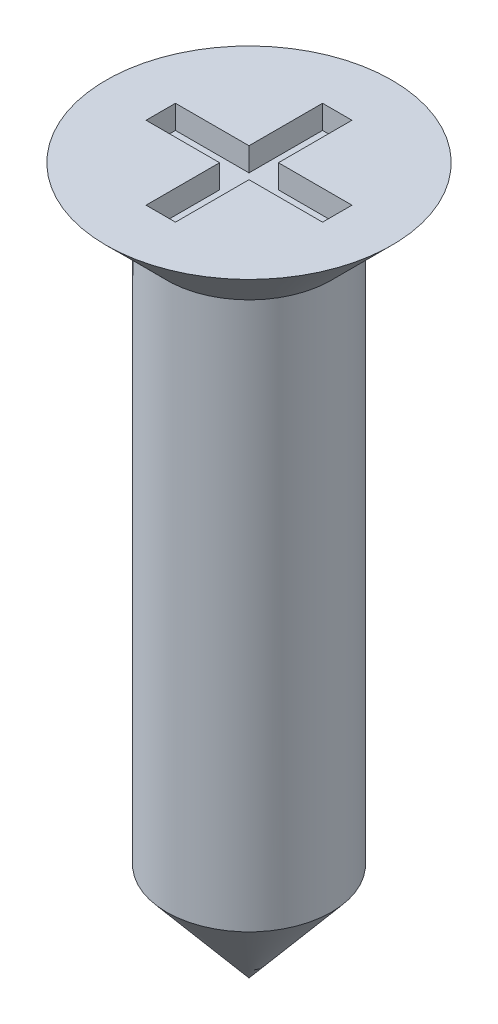
ISO-10303-21;
HEADER;
FILE_DESCRIPTION(('STEP AP214'),'2;1');
FILE_NAME('part.step','',(''),(''),'','','');
FILE_SCHEMA(('AUTOMOTIVE_DESIGN { 1 0 10303 214 1 1 1 1 }'));
ENDSEC;
DATA;
#1=APPLICATION_CONTEXT('core data for automotive mechanical design processes');
#2=APPLICATION_PROTOCOL_DEFINITION('international standard','automotive_design',2000,#1);
#3=PRODUCT_CONTEXT('',#1,'mechanical');
#4=PRODUCT('Part','Part','',(#3));
#5=PRODUCT_RELATED_PRODUCT_CATEGORY('part','',(#4));
#6=PRODUCT_DEFINITION_FORMATION('','',#4);
#7=PRODUCT_DEFINITION_CONTEXT('part definition',#1,'design');
#8=PRODUCT_DEFINITION('design','',#6,#7);
#9=PRODUCT_DEFINITION_SHAPE('','',#8);
#10=(LENGTH_UNIT() NAMED_UNIT(*) SI_UNIT(.MILLI.,.METRE.));
#11=(NAMED_UNIT(*) PLANE_ANGLE_UNIT() SI_UNIT($,.RADIAN.));
#12=(NAMED_UNIT(*) SI_UNIT($,.STERADIAN.) SOLID_ANGLE_UNIT());
#13=UNCERTAINTY_MEASURE_WITH_UNIT(LENGTH_MEASURE(1.E-05),#10,'distance_accuracy_value','');
#14=(GEOMETRIC_REPRESENTATION_CONTEXT(3) GLOBAL_UNCERTAINTY_ASSIGNED_CONTEXT((#13)) GLOBAL_UNIT_ASSIGNED_CONTEXT((#10,
#11,#12)) REPRESENTATION_CONTEXT('',''));
#15=CARTESIAN_POINT('',(0.,0.,0.));
#16=DIRECTION('',(0.,0.,1.));
#17=DIRECTION('',(1.,0.,0.));
#18=AXIS2_PLACEMENT_3D('',#15,#16,#17);
#19=CARTESIAN_POINT('',(0.,-5.16577248518406,0.));
#20=DIRECTION('',(0.,1.,0.));
#21=DIRECTION('',(0.,0.,1.));
#22=AXIS2_PLACEMENT_3D('',#19,#20,#21);
#23=CONICAL_SURFACE('',#22,0.699999999999999,0.698131700797737);
#24=CARTESIAN_POINT('',(0.,-6.,0.));
#25=VERTEX_POINT('',#24);
#26=VERTEX_LOOP('',#25);
#27=FACE_BOUND('',#26,.T.);
#28=CARTESIAN_POINT('',(0.,-5.16577248518406,0.));
#29=DIRECTION('',(0.,-1.,0.));
#30=DIRECTION('',(0.,0.,-1.));
#31=AXIS2_PLACEMENT_3D('',#28,#29,#30);
#32=CIRCLE('',#31,0.699999999999999);
#33=CARTESIAN_POINT('',(0.,-5.16577248518406,-0.699999999999999));
#34=VERTEX_POINT('',#33);
#35=EDGE_CURVE('E11',#34,#34,#32,.T.);
#36=ORIENTED_EDGE('',*,*,#35,.T.);
#37=EDGE_LOOP('',(#36));
#38=FACE_BOUND('',#37,.T.);
#39=ADVANCED_FACE('F36',(#27,#38),#23,.T.);
#40=CARTESIAN_POINT('',(0.,-6.,0.));
#41=DIRECTION('',(0.,-1.,0.));
#42=DIRECTION('',(0.,0.,-1.));
#43=AXIS2_PLACEMENT_3D('',#40,#41,#42);
#44=CYLINDRICAL_SURFACE('',#43,0.7);
#45=ORIENTED_EDGE('',*,*,#35,.F.);
#46=EDGE_LOOP('',(#45));
#47=FACE_BOUND('',#46,.T.);
#48=CARTESIAN_POINT('',(0.,-0.514999999999995,0.));
#49=DIRECTION('',(0.,-1.,0.));
#50=DIRECTION('',(0.,0.,-1.));
#51=AXIS2_PLACEMENT_3D('',#48,#49,#50);
#52=CIRCLE('',#51,0.7);
#53=CARTESIAN_POINT('',(0.,-0.514999999999995,-0.7));
#54=VERTEX_POINT('',#53);
#55=EDGE_CURVE('E43',#54,#54,#52,.T.);
#56=ORIENTED_EDGE('',*,*,#55,.T.);
#57=EDGE_LOOP('',(#56));
#58=FACE_BOUND('',#57,.T.);
#59=ADVANCED_FACE('F231',(#47,#58),#44,.T.);
#60=CARTESIAN_POINT('',(0.,0.,0.));
#61=DIRECTION('',(0.,1.,0.));
#62=DIRECTION('',(0.,0.,1.));
#63=AXIS2_PLACEMENT_3D('',#60,#61,#62);
#64=CONICAL_SURFACE('',#63,1.215,0.785398163397454);
#65=ORIENTED_EDGE('',*,*,#55,.F.);
#66=EDGE_LOOP('',(#65));
#67=FACE_BOUND('',#66,.T.);
#68=CARTESIAN_POINT('',(0.,0.,0.));
#69=DIRECTION('',(0.,-1.,0.));
#70=DIRECTION('',(0.,0.,-1.));
#71=AXIS2_PLACEMENT_3D('',#68,#69,#70);
#72=CIRCLE('',#71,1.215);
#73=CARTESIAN_POINT('',(0.,0.,-1.215));
#74=VERTEX_POINT('',#73);
#75=EDGE_CURVE('E207',#74,#74,#72,.T.);
#76=ORIENTED_EDGE('',*,*,#75,.T.);
#77=EDGE_LOOP('',(#76));
#78=FACE_BOUND('',#77,.T.);
#79=ADVANCED_FACE('F233',(#67,#78),#64,.T.);
#80=CARTESIAN_POINT('',(0.,0.,0.));
#81=DIRECTION('',(0.,-1.,0.));
#82=DIRECTION('',(0.,0.,-1.));
#83=AXIS2_PLACEMENT_3D('',#80,#81,#82);
#84=PLANE('',#83);
#85=DIRECTION('',(0.,0.,-1.));
#86=VECTOR('',#85,1.);
#87=CARTESIAN_POINT('',(0.125,0.,-0.125));
#88=LINE('',#87,#86);
#89=CARTESIAN_POINT('',(0.125,0.,-0.125));
#90=VERTEX_POINT('',#89);
#91=CARTESIAN_POINT('',(0.125,0.,-0.75));
#92=VERTEX_POINT('',#91);
#93=EDGE_CURVE('E177',#90,#92,#88,.T.);
#94=ORIENTED_EDGE('',*,*,#93,.F.);
#95=DIRECTION('',(-1.,0.,0.));
#96=VECTOR('',#95,1.);
#97=CARTESIAN_POINT('',(0.125,0.,-0.125));
#98=LINE('',#97,#96);
#99=CARTESIAN_POINT('',(0.75,0.,-0.125));
#100=VERTEX_POINT('',#99);
#101=EDGE_CURVE('E50',#100,#90,#98,.T.);
#102=ORIENTED_EDGE('',*,*,#101,.F.);
#103=DIRECTION('',(0.,0.,-1.));
#104=VECTOR('',#103,1.);
#105=CARTESIAN_POINT('',(0.75,0.,0.125));
#106=LINE('',#105,#104);
#107=CARTESIAN_POINT('',(0.75,0.,0.125));
#108=VERTEX_POINT('',#107);
#109=EDGE_CURVE('E145',#108,#100,#106,.T.);
#110=ORIENTED_EDGE('',*,*,#109,.F.);
#111=DIRECTION('',(1.,0.,0.));
#112=VECTOR('',#111,1.);
#113=CARTESIAN_POINT('',(0.125,0.,0.125));
#114=LINE('',#113,#112);
#115=CARTESIAN_POINT('',(0.125,0.,0.125));
#116=VERTEX_POINT('',#115);
#117=EDGE_CURVE('E148',#116,#108,#114,.T.);
#118=ORIENTED_EDGE('',*,*,#117,.F.);
#119=DIRECTION('',(0.,0.,-1.));
#120=VECTOR('',#119,1.);
#121=CARTESIAN_POINT('',(0.125,0.,0.75));
#122=LINE('',#121,#120);
#123=CARTESIAN_POINT('',(0.125,0.,0.75));
#124=VERTEX_POINT('',#123);
#125=EDGE_CURVE('E200',#124,#116,#122,.T.);
#126=ORIENTED_EDGE('',*,*,#125,.F.);
#127=DIRECTION('',(1.,0.,0.));
#128=VECTOR('',#127,1.);
#129=CARTESIAN_POINT('',(-0.125,0.,0.75));
#130=LINE('',#129,#128);
#131=CARTESIAN_POINT('',(-0.125,0.,0.75));
#132=VERTEX_POINT('',#131);
#133=EDGE_CURVE('E197',#132,#124,#130,.T.);
#134=ORIENTED_EDGE('',*,*,#133,.F.);
#135=DIRECTION('',(0.,0.,1.));
#136=VECTOR('',#135,1.);
#137=CARTESIAN_POINT('',(-0.125,0.,0.75));
#138=LINE('',#137,#136);
#139=CARTESIAN_POINT('',(-0.125,0.,0.125));
#140=VERTEX_POINT('',#139);
#141=EDGE_CURVE('E194',#140,#132,#138,.T.);
#142=ORIENTED_EDGE('',*,*,#141,.F.);
#143=DIRECTION('',(1.,0.,0.));
#144=VECTOR('',#143,1.);
#145=CARTESIAN_POINT('',(-0.75,0.,0.125));
#146=LINE('',#145,#144);
#147=CARTESIAN_POINT('',(-0.75,0.,0.125));
#148=VERTEX_POINT('',#147);
#149=EDGE_CURVE('E191',#148,#140,#146,.T.);
#150=ORIENTED_EDGE('',*,*,#149,.F.);
#151=DIRECTION('',(0.,0.,1.));
#152=VECTOR('',#151,1.);
#153=CARTESIAN_POINT('',(-0.75,0.,0.125));
#154=LINE('',#153,#152);
#155=CARTESIAN_POINT('',(-0.75,0.,-0.125));
#156=VERTEX_POINT('',#155);
#157=EDGE_CURVE('E188',#156,#148,#154,.T.);
#158=ORIENTED_EDGE('',*,*,#157,.F.);
#159=DIRECTION('',(-1.,0.,0.));
#160=VECTOR('',#159,1.);
#161=CARTESIAN_POINT('',(-0.75,0.,-0.125));
#162=LINE('',#161,#160);
#163=CARTESIAN_POINT('',(-0.125,0.,-0.125));
#164=VERTEX_POINT('',#163);
#165=EDGE_CURVE('E185',#164,#156,#162,.T.);
#166=ORIENTED_EDGE('',*,*,#165,.F.);
#167=DIRECTION('',(0.,0.,1.));
#168=VECTOR('',#167,1.);
#169=CARTESIAN_POINT('',(-0.125,0.,-0.125));
#170=LINE('',#169,#168);
#171=CARTESIAN_POINT('',(-0.125,0.,-0.75));
#172=VERTEX_POINT('',#171);
#173=EDGE_CURVE('E182',#172,#164,#170,.T.);
#174=ORIENTED_EDGE('',*,*,#173,.F.);
#175=DIRECTION('',(-1.,0.,0.));
#176=VECTOR('',#175,1.);
#177=CARTESIAN_POINT('',(-0.125,0.,-0.75));
#178=LINE('',#177,#176);
#179=EDGE_CURVE('E179',#92,#172,#178,.T.);
#180=ORIENTED_EDGE('',*,*,#179,.F.);
#181=EDGE_LOOP('',(#94,#102,#110,#118,#126,#134,#142,#150,#158,#166,#174,#180));
#182=FACE_BOUND('',#181,.T.);
#183=ORIENTED_EDGE('',*,*,#75,.F.);
#184=EDGE_LOOP('',(#183));
#185=FACE_BOUND('',#184,.T.);
#186=ADVANCED_FACE('F236',(#182,#185),#84,.F.);
#187=CARTESIAN_POINT('',(0.125,-0.2,-0.125));
#188=DIRECTION('',(0.,0.,-1.));
#189=DIRECTION('',(-1.,0.,0.));
#190=AXIS2_PLACEMENT_3D('',#187,#188,#189);
#191=PLANE('',#190);
#192=ORIENTED_EDGE('',*,*,#101,.T.);
#193=DIRECTION('',(0.,1.,0.));
#194=VECTOR('',#193,1.);
#195=CARTESIAN_POINT('',(0.125,-0.2,-0.125));
#196=LINE('',#195,#194);
#197=CARTESIAN_POINT('',(0.125,-0.2,-0.125));
#198=VERTEX_POINT('',#197);
#199=EDGE_CURVE('E122',#198,#90,#196,.T.);
#200=ORIENTED_EDGE('',*,*,#199,.F.);
#201=DIRECTION('',(-1.,0.,0.));
#202=VECTOR('',#201,1.);
#203=CARTESIAN_POINT('',(0.125,-0.2,-0.125));
#204=LINE('',#203,#202);
#205=CARTESIAN_POINT('',(0.75,-0.2,-0.125));
#206=VERTEX_POINT('',#205);
#207=EDGE_CURVE('E126',#206,#198,#204,.T.);
#208=ORIENTED_EDGE('',*,*,#207,.F.);
#209=DIRECTION('',(0.,1.,0.));
#210=VECTOR('',#209,1.);
#211=CARTESIAN_POINT('',(0.75,-0.2,-0.125));
#212=LINE('',#211,#210);
#213=EDGE_CURVE('E205',#206,#100,#212,.T.);
#214=ORIENTED_EDGE('',*,*,#213,.T.);
#215=EDGE_LOOP('',(#192,#200,#208,#214));
#216=FACE_BOUND('',#215,.T.);
#217=ADVANCED_FACE('F124',(#216),#191,.F.);
#218=CARTESIAN_POINT('',(0.75,-0.2,0.125));
#219=DIRECTION('',(1.,0.,0.));
#220=DIRECTION('',(0.,0.,-1.));
#221=AXIS2_PLACEMENT_3D('',#218,#219,#220);
#222=PLANE('',#221);
#223=ORIENTED_EDGE('',*,*,#109,.T.);
#224=ORIENTED_EDGE('',*,*,#213,.F.);
#225=DIRECTION('',(0.,0.,-1.));
#226=VECTOR('',#225,1.);
#227=CARTESIAN_POINT('',(0.75,-0.2,0.125));
#228=LINE('',#227,#226);
#229=CARTESIAN_POINT('',(0.75,-0.2,0.125));
#230=VERTEX_POINT('',#229);
#231=EDGE_CURVE('E132',#230,#206,#228,.T.);
#232=ORIENTED_EDGE('',*,*,#231,.F.);
#233=DIRECTION('',(0.,1.,0.));
#234=VECTOR('',#233,1.);
#235=CARTESIAN_POINT('',(0.75,-0.2,0.125));
#236=LINE('',#235,#234);
#237=EDGE_CURVE('E208',#230,#108,#236,.T.);
#238=ORIENTED_EDGE('',*,*,#237,.T.);
#239=EDGE_LOOP('',(#223,#224,#232,#238));
#240=FACE_BOUND('',#239,.T.);
#241=ADVANCED_FACE('F246',(#240),#222,.F.);
#242=CARTESIAN_POINT('',(0.125,-0.2,0.125));
#243=DIRECTION('',(0.,0.,1.));
#244=DIRECTION('',(1.,0.,0.));
#245=AXIS2_PLACEMENT_3D('',#242,#243,#244);
#246=PLANE('',#245);
#247=ORIENTED_EDGE('',*,*,#117,.T.);
#248=ORIENTED_EDGE('',*,*,#237,.F.);
#249=DIRECTION('',(1.,0.,0.));
#250=VECTOR('',#249,1.);
#251=CARTESIAN_POINT('',(0.125,-0.2,0.125));
#252=LINE('',#251,#250);
#253=CARTESIAN_POINT('',(0.125,-0.2,0.125));
#254=VERTEX_POINT('',#253);
#255=EDGE_CURVE('E173',#254,#230,#252,.T.);
#256=ORIENTED_EDGE('',*,*,#255,.F.);
#257=DIRECTION('',(0.,1.,0.));
#258=VECTOR('',#257,1.);
#259=CARTESIAN_POINT('',(0.125,-0.2,0.125));
#260=LINE('',#259,#258);
#261=EDGE_CURVE('E210',#254,#116,#260,.T.);
#262=ORIENTED_EDGE('',*,*,#261,.T.);
#263=EDGE_LOOP('',(#247,#248,#256,#262));
#264=FACE_BOUND('',#263,.T.);
#265=ADVANCED_FACE('F280',(#264),#246,.F.);
#266=CARTESIAN_POINT('',(0.125,-0.2,0.75));
#267=DIRECTION('',(1.,0.,0.));
#268=DIRECTION('',(0.,0.,-1.));
#269=AXIS2_PLACEMENT_3D('',#266,#267,#268);
#270=PLANE('',#269);
#271=ORIENTED_EDGE('',*,*,#125,.T.);
#272=ORIENTED_EDGE('',*,*,#261,.F.);
#273=DIRECTION('',(0.,0.,-1.));
#274=VECTOR('',#273,1.);
#275=CARTESIAN_POINT('',(0.125,-0.2,0.75));
#276=LINE('',#275,#274);
#277=CARTESIAN_POINT('',(0.125,-0.2,0.75));
#278=VERTEX_POINT('',#277);
#279=EDGE_CURVE('E170',#278,#254,#276,.T.);
#280=ORIENTED_EDGE('',*,*,#279,.F.);
#281=DIRECTION('',(0.,1.,0.));
#282=VECTOR('',#281,1.);
#283=CARTESIAN_POINT('',(0.125,-0.2,0.75));
#284=LINE('',#283,#282);
#285=EDGE_CURVE('E212',#278,#124,#284,.T.);
#286=ORIENTED_EDGE('',*,*,#285,.T.);
#287=EDGE_LOOP('',(#271,#272,#280,#286));
#288=FACE_BOUND('',#287,.T.);
#289=ADVANCED_FACE('F290',(#288),#270,.F.);
#290=CARTESIAN_POINT('',(-0.125,-0.2,0.75));
#291=DIRECTION('',(0.,0.,1.));
#292=DIRECTION('',(1.,0.,0.));
#293=AXIS2_PLACEMENT_3D('',#290,#291,#292);
#294=PLANE('',#293);
#295=ORIENTED_EDGE('',*,*,#133,.T.);
#296=ORIENTED_EDGE('',*,*,#285,.F.);
#297=DIRECTION('',(1.,0.,0.));
#298=VECTOR('',#297,1.);
#299=CARTESIAN_POINT('',(-0.125,-0.2,0.75));
#300=LINE('',#299,#298);
#301=CARTESIAN_POINT('',(-0.125,-0.2,0.75));
#302=VERTEX_POINT('',#301);
#303=EDGE_CURVE('E167',#302,#278,#300,.T.);
#304=ORIENTED_EDGE('',*,*,#303,.F.);
#305=DIRECTION('',(0.,1.,0.));
#306=VECTOR('',#305,1.);
#307=CARTESIAN_POINT('',(-0.125,-0.2,0.75));
#308=LINE('',#307,#306);
#309=EDGE_CURVE('E214',#302,#132,#308,.T.);
#310=ORIENTED_EDGE('',*,*,#309,.T.);
#311=EDGE_LOOP('',(#295,#296,#304,#310));
#312=FACE_BOUND('',#311,.T.);
#313=ADVANCED_FACE('F300',(#312),#294,.F.);
#314=CARTESIAN_POINT('',(-0.125,-0.2,0.75));
#315=DIRECTION('',(-1.,0.,0.));
#316=DIRECTION('',(0.,0.,1.));
#317=AXIS2_PLACEMENT_3D('',#314,#315,#316);
#318=PLANE('',#317);
#319=ORIENTED_EDGE('',*,*,#141,.T.);
#320=ORIENTED_EDGE('',*,*,#309,.F.);
#321=DIRECTION('',(0.,0.,1.));
#322=VECTOR('',#321,1.);
#323=CARTESIAN_POINT('',(-0.125,-0.2,0.75));
#324=LINE('',#323,#322);
#325=CARTESIAN_POINT('',(-0.125,-0.2,0.125));
#326=VERTEX_POINT('',#325);
#327=EDGE_CURVE('E164',#326,#302,#324,.T.);
#328=ORIENTED_EDGE('',*,*,#327,.F.);
#329=DIRECTION('',(0.,1.,0.));
#330=VECTOR('',#329,1.);
#331=CARTESIAN_POINT('',(-0.125,-0.2,0.125));
#332=LINE('',#331,#330);
#333=EDGE_CURVE('E216',#326,#140,#332,.T.);
#334=ORIENTED_EDGE('',*,*,#333,.T.);
#335=EDGE_LOOP('',(#319,#320,#328,#334));
#336=FACE_BOUND('',#335,.T.);
#337=ADVANCED_FACE('F310',(#336),#318,.F.);
#338=CARTESIAN_POINT('',(-0.75,-0.2,0.125));
#339=DIRECTION('',(0.,0.,1.));
#340=DIRECTION('',(1.,0.,0.));
#341=AXIS2_PLACEMENT_3D('',#338,#339,#340);
#342=PLANE('',#341);
#343=ORIENTED_EDGE('',*,*,#149,.T.);
#344=ORIENTED_EDGE('',*,*,#333,.F.);
#345=DIRECTION('',(1.,0.,0.));
#346=VECTOR('',#345,1.);
#347=CARTESIAN_POINT('',(-0.75,-0.2,0.125));
#348=LINE('',#347,#346);
#349=CARTESIAN_POINT('',(-0.75,-0.2,0.125));
#350=VERTEX_POINT('',#349);
#351=EDGE_CURVE('E161',#350,#326,#348,.T.);
#352=ORIENTED_EDGE('',*,*,#351,.F.);
#353=DIRECTION('',(0.,1.,0.));
#354=VECTOR('',#353,1.);
#355=CARTESIAN_POINT('',(-0.75,-0.2,0.125));
#356=LINE('',#355,#354);
#357=EDGE_CURVE('E218',#350,#148,#356,.T.);
#358=ORIENTED_EDGE('',*,*,#357,.T.);
#359=EDGE_LOOP('',(#343,#344,#352,#358));
#360=FACE_BOUND('',#359,.T.);
#361=ADVANCED_FACE('F320',(#360),#342,.F.);
#362=CARTESIAN_POINT('',(-0.75,-0.2,0.125));
#363=DIRECTION('',(-1.,0.,0.));
#364=DIRECTION('',(0.,0.,1.));
#365=AXIS2_PLACEMENT_3D('',#362,#363,#364);
#366=PLANE('',#365);
#367=ORIENTED_EDGE('',*,*,#157,.T.);
#368=ORIENTED_EDGE('',*,*,#357,.F.);
#369=DIRECTION('',(0.,0.,1.));
#370=VECTOR('',#369,1.);
#371=CARTESIAN_POINT('',(-0.75,-0.2,0.125));
#372=LINE('',#371,#370);
#373=CARTESIAN_POINT('',(-0.75,-0.2,-0.125));
#374=VERTEX_POINT('',#373);
#375=EDGE_CURVE('E158',#374,#350,#372,.T.);
#376=ORIENTED_EDGE('',*,*,#375,.F.);
#377=DIRECTION('',(0.,1.,0.));
#378=VECTOR('',#377,1.);
#379=CARTESIAN_POINT('',(-0.75,-0.2,-0.125));
#380=LINE('',#379,#378);
#381=EDGE_CURVE('E220',#374,#156,#380,.T.);
#382=ORIENTED_EDGE('',*,*,#381,.T.);
#383=EDGE_LOOP('',(#367,#368,#376,#382));
#384=FACE_BOUND('',#383,.T.);
#385=ADVANCED_FACE('F330',(#384),#366,.F.);
#386=CARTESIAN_POINT('',(-0.75,-0.2,-0.125));
#387=DIRECTION('',(0.,0.,-1.));
#388=DIRECTION('',(-1.,0.,0.));
#389=AXIS2_PLACEMENT_3D('',#386,#387,#388);
#390=PLANE('',#389);
#391=ORIENTED_EDGE('',*,*,#165,.T.);
#392=ORIENTED_EDGE('',*,*,#381,.F.);
#393=DIRECTION('',(-1.,0.,0.));
#394=VECTOR('',#393,1.);
#395=CARTESIAN_POINT('',(-0.75,-0.2,-0.125));
#396=LINE('',#395,#394);
#397=CARTESIAN_POINT('',(-0.125,-0.2,-0.125));
#398=VERTEX_POINT('',#397);
#399=EDGE_CURVE('E155',#398,#374,#396,.T.);
#400=ORIENTED_EDGE('',*,*,#399,.F.);
#401=DIRECTION('',(0.,1.,0.));
#402=VECTOR('',#401,1.);
#403=CARTESIAN_POINT('',(-0.125,-0.2,-0.125));
#404=LINE('',#403,#402);
#405=EDGE_CURVE('E222',#398,#164,#404,.T.);
#406=ORIENTED_EDGE('',*,*,#405,.T.);
#407=EDGE_LOOP('',(#391,#392,#400,#406));
#408=FACE_BOUND('',#407,.T.);
#409=ADVANCED_FACE('F340',(#408),#390,.F.);
#410=CARTESIAN_POINT('',(-0.125,-0.2,-0.125));
#411=DIRECTION('',(-1.,0.,0.));
#412=DIRECTION('',(0.,0.,1.));
#413=AXIS2_PLACEMENT_3D('',#410,#411,#412);
#414=PLANE('',#413);
#415=ORIENTED_EDGE('',*,*,#173,.T.);
#416=ORIENTED_EDGE('',*,*,#405,.F.);
#417=DIRECTION('',(0.,0.,1.));
#418=VECTOR('',#417,1.);
#419=CARTESIAN_POINT('',(-0.125,-0.2,-0.125));
#420=LINE('',#419,#418);
#421=CARTESIAN_POINT('',(-0.125,-0.2,-0.75));
#422=VERTEX_POINT('',#421);
#423=EDGE_CURVE('E152',#422,#398,#420,.T.);
#424=ORIENTED_EDGE('',*,*,#423,.F.);
#425=DIRECTION('',(0.,1.,0.));
#426=VECTOR('',#425,1.);
#427=CARTESIAN_POINT('',(-0.125,-0.2,-0.75));
#428=LINE('',#427,#426);
#429=EDGE_CURVE('E224',#422,#172,#428,.T.);
#430=ORIENTED_EDGE('',*,*,#429,.T.);
#431=EDGE_LOOP('',(#415,#416,#424,#430));
#432=FACE_BOUND('',#431,.T.);
#433=ADVANCED_FACE('F350',(#432),#414,.F.);
#434=CARTESIAN_POINT('',(-0.125,-0.2,-0.75));
#435=DIRECTION('',(0.,0.,-1.));
#436=DIRECTION('',(-1.,0.,0.));
#437=AXIS2_PLACEMENT_3D('',#434,#435,#436);
#438=PLANE('',#437);
#439=ORIENTED_EDGE('',*,*,#179,.T.);
#440=ORIENTED_EDGE('',*,*,#429,.F.);
#441=DIRECTION('',(-1.,0.,0.));
#442=VECTOR('',#441,1.);
#443=CARTESIAN_POINT('',(-0.125,-0.2,-0.75));
#444=LINE('',#443,#442);
#445=CARTESIAN_POINT('',(0.125,-0.2,-0.75));
#446=VERTEX_POINT('',#445);
#447=EDGE_CURVE('E140',#446,#422,#444,.T.);
#448=ORIENTED_EDGE('',*,*,#447,.F.);
#449=DIRECTION('',(0.,1.,0.));
#450=VECTOR('',#449,1.);
#451=CARTESIAN_POINT('',(0.125,-0.2,-0.75));
#452=LINE('',#451,#450);
#453=EDGE_CURVE('E131',#446,#92,#452,.T.);
#454=ORIENTED_EDGE('',*,*,#453,.T.);
#455=EDGE_LOOP('',(#439,#440,#448,#454));
#456=FACE_BOUND('',#455,.T.);
#457=ADVANCED_FACE('F360',(#456),#438,.F.);
#458=CARTESIAN_POINT('',(0.125,-0.2,-0.125));
#459=DIRECTION('',(1.,0.,0.));
#460=DIRECTION('',(0.,0.,-1.));
#461=AXIS2_PLACEMENT_3D('',#458,#459,#460);
#462=PLANE('',#461);
#463=ORIENTED_EDGE('',*,*,#93,.T.);
#464=ORIENTED_EDGE('',*,*,#453,.F.);
#465=DIRECTION('',(0.,0.,-1.));
#466=VECTOR('',#465,1.);
#467=CARTESIAN_POINT('',(0.125,-0.2,-0.125));
#468=LINE('',#467,#466);
#469=EDGE_CURVE('E135',#198,#446,#468,.T.);
#470=ORIENTED_EDGE('',*,*,#469,.F.);
#471=ORIENTED_EDGE('',*,*,#199,.T.);
#472=EDGE_LOOP('',(#463,#464,#470,#471));
#473=FACE_BOUND('',#472,.T.);
#474=ADVANCED_FACE('F136',(#473),#462,.F.);
#475=CARTESIAN_POINT('',(0.,-0.2,0.));
#476=DIRECTION('',(0.,1.,0.));
#477=DIRECTION('',(0.,0.,1.));
#478=AXIS2_PLACEMENT_3D('',#475,#476,#477);
#479=PLANE('',#478);
#480=ORIENTED_EDGE('',*,*,#207,.T.);
#481=ORIENTED_EDGE('',*,*,#469,.T.);
#482=ORIENTED_EDGE('',*,*,#447,.T.);
#483=ORIENTED_EDGE('',*,*,#423,.T.);
#484=ORIENTED_EDGE('',*,*,#399,.T.);
#485=ORIENTED_EDGE('',*,*,#375,.T.);
#486=ORIENTED_EDGE('',*,*,#351,.T.);
#487=ORIENTED_EDGE('',*,*,#327,.T.);
#488=ORIENTED_EDGE('',*,*,#303,.T.);
#489=ORIENTED_EDGE('',*,*,#279,.T.);
#490=ORIENTED_EDGE('',*,*,#255,.T.);
#491=ORIENTED_EDGE('',*,*,#231,.T.);
#492=EDGE_LOOP('',(#480,#481,#482,#483,#484,#485,#486,#487,#488,#489,#490,#491));
#493=FACE_BOUND('',#492,.T.);
#494=ADVANCED_FACE('F142',(#493),#479,.T.);
#495=CLOSED_SHELL('',(#39,#59,#79,#186,#217,#241,#265,#289,#313,#337,#361,#385,#409,#433,#457,
#474,#494));
#496=MANIFOLD_SOLID_BREP('B2',#495);
#497=ADVANCED_BREP_SHAPE_REPRESENTATION('',(#18,#496),#14);
#498=SHAPE_DEFINITION_REPRESENTATION(#9,#497);
ENDSEC;
END-ISO-10303-21;
